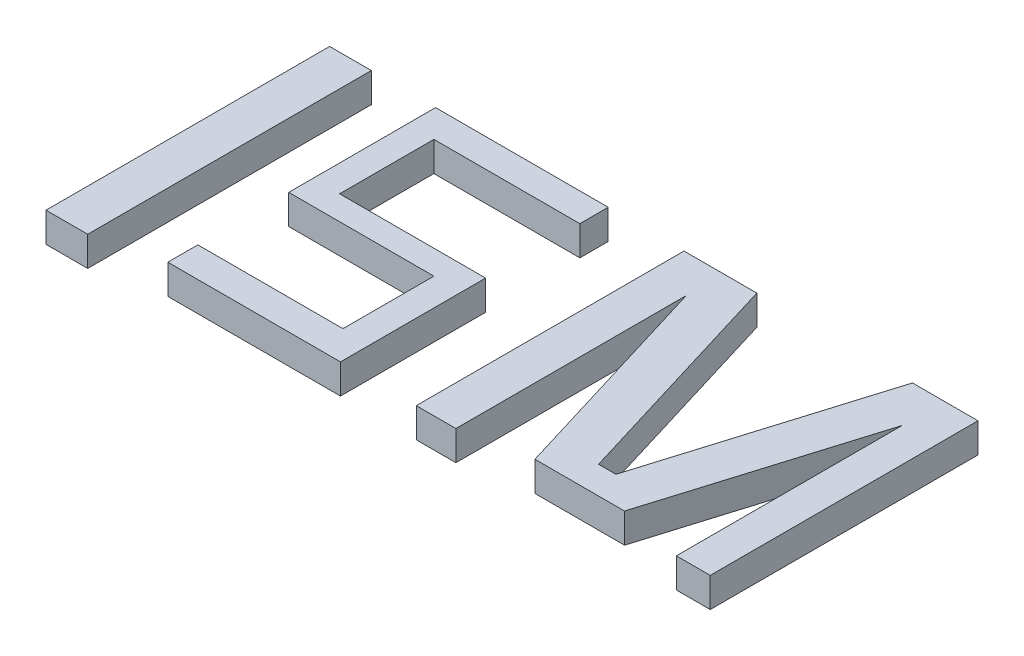
ISO-10303-21;
HEADER;
FILE_DESCRIPTION(('STEP AP214'),'2;1');
FILE_NAME('part.step','',(''),(''),'','','');
FILE_SCHEMA(('AUTOMOTIVE_DESIGN { 1 0 10303 214 1 1 1 1 }'));
ENDSEC;
DATA;
#1=APPLICATION_CONTEXT('core data for automotive mechanical design processes');
#2=APPLICATION_PROTOCOL_DEFINITION('international standard','automotive_design',2000,#1);
#3=PRODUCT_CONTEXT('',#1,'mechanical');
#4=PRODUCT('Part','Part','',(#3));
#5=PRODUCT_RELATED_PRODUCT_CATEGORY('part','',(#4));
#6=PRODUCT_DEFINITION_FORMATION('','',#4);
#7=PRODUCT_DEFINITION_CONTEXT('part definition',#1,'design');
#8=PRODUCT_DEFINITION('design','',#6,#7);
#9=PRODUCT_DEFINITION_SHAPE('','',#8);
#10=(LENGTH_UNIT() NAMED_UNIT(*) SI_UNIT(.MILLI.,.METRE.));
#11=(NAMED_UNIT(*) PLANE_ANGLE_UNIT() SI_UNIT($,.RADIAN.));
#12=(NAMED_UNIT(*) SI_UNIT($,.STERADIAN.) SOLID_ANGLE_UNIT());
#13=UNCERTAINTY_MEASURE_WITH_UNIT(LENGTH_MEASURE(1.E-05),#10,'distance_accuracy_value','');
#14=(GEOMETRIC_REPRESENTATION_CONTEXT(3) GLOBAL_UNCERTAINTY_ASSIGNED_CONTEXT((#13)) GLOBAL_UNIT_ASSIGNED_CONTEXT((#10,
#11,#12)) REPRESENTATION_CONTEXT('',''));
#15=CARTESIAN_POINT('',(0.,0.,0.));
#16=DIRECTION('',(0.,0.,1.));
#17=DIRECTION('',(1.,0.,0.));
#18=AXIS2_PLACEMENT_3D('',#15,#16,#17);
#19=CARTESIAN_POINT('',(28.2958438703198,10.,-42.3733781341606));
#20=DIRECTION('',(-1.,0.,0.));
#21=DIRECTION('',(0.,0.,1.));
#22=AXIS2_PLACEMENT_3D('',#19,#20,#21);
#23=PLANE('',#22);
#24=DIRECTION('',(0.,0.,-1.));
#25=VECTOR('',#24,1.);
#26=CARTESIAN_POINT('',(28.2958438703198,0.,-42.3733781341606));
#27=LINE('',#26,#25);
#28=CARTESIAN_POINT('',(28.2958438703198,0.,-42.3733781341606));
#29=VERTEX_POINT('',#28);
#30=CARTESIAN_POINT('',(28.2958438703198,0.,-51.9461014335723));
#31=VERTEX_POINT('',#30);
#32=EDGE_CURVE('E164',#29,#31,#27,.T.);
#33=ORIENTED_EDGE('',*,*,#32,.T.);
#34=DIRECTION('',(0.,-1.,0.));
#35=VECTOR('',#34,1.);
#36=CARTESIAN_POINT('',(28.2958438703198,10.,-51.9461014335723));
#37=LINE('',#36,#35);
#38=CARTESIAN_POINT('',(28.2958438703198,10.,-51.9461014335723));
#39=VERTEX_POINT('',#38);
#40=EDGE_CURVE('E12',#39,#31,#37,.T.);
#41=ORIENTED_EDGE('',*,*,#40,.F.);
#42=DIRECTION('',(0.,0.,-1.));
#43=VECTOR('',#42,1.);
#44=CARTESIAN_POINT('',(28.2958438703198,10.,-42.3733781341606));
#45=LINE('',#44,#43);
#46=CARTESIAN_POINT('',(28.2958438703198,10.,-42.3733781341606));
#47=VERTEX_POINT('',#46);
#48=EDGE_CURVE('E186',#47,#39,#45,.T.);
#49=ORIENTED_EDGE('',*,*,#48,.F.);
#50=DIRECTION('',(0.,-1.,0.));
#51=VECTOR('',#50,1.);
#52=CARTESIAN_POINT('',(28.2958438703198,10.,-42.3733781341606));
#53=LINE('',#52,#51);
#54=EDGE_CURVE('E160',#47,#29,#53,.T.);
#55=ORIENTED_EDGE('',*,*,#54,.T.);
#56=EDGE_LOOP('',(#33,#41,#49,#55));
#57=FACE_BOUND('',#56,.T.);
#58=ADVANCED_FACE('F44',(#57),#23,.F.);
#59=CARTESIAN_POINT('',(28.2958438703198,10.,-51.9461014335723));
#60=DIRECTION('',(0.,0.,1.));
#61=DIRECTION('',(1.,0.,0.));
#62=AXIS2_PLACEMENT_3D('',#59,#60,#61);
#63=PLANE('',#62);
#64=DIRECTION('',(-1.,0.,0.));
#65=VECTOR('',#64,1.);
#66=CARTESIAN_POINT('',(28.2958438703198,0.,-51.9461014335723));
#67=LINE('',#66,#65);
#68=CARTESIAN_POINT('',(-29.9851479819807,0.,-51.9461014335723));
#69=VERTEX_POINT('',#68);
#70=EDGE_CURVE('E167',#31,#69,#67,.T.);
#71=ORIENTED_EDGE('',*,*,#70,.T.);
#72=DIRECTION('',(0.,-1.,0.));
#73=VECTOR('',#72,1.);
#74=CARTESIAN_POINT('',(-29.9851479819807,10.,-51.9461014335723));
#75=LINE('',#74,#73);
#76=CARTESIAN_POINT('',(-29.9851479819807,10.,-51.9461014335723));
#77=VERTEX_POINT('',#76);
#78=EDGE_CURVE('E52',#77,#69,#75,.T.);
#79=ORIENTED_EDGE('',*,*,#78,.F.);
#80=DIRECTION('',(-1.,0.,0.));
#81=VECTOR('',#80,1.);
#82=CARTESIAN_POINT('',(28.2958438703198,10.,-51.9461014335723));
#83=LINE('',#82,#81);
#84=EDGE_CURVE('E115',#39,#77,#83,.T.);
#85=ORIENTED_EDGE('',*,*,#84,.F.);
#86=ORIENTED_EDGE('',*,*,#40,.T.);
#87=EDGE_LOOP('',(#71,#79,#85,#86));
#88=FACE_BOUND('',#87,.T.);
#89=ADVANCED_FACE('F264',(#88),#63,.F.);
#90=CARTESIAN_POINT('',(-29.9851479819807,10.,-51.9461014335723));
#91=DIRECTION('',(1.,0.,0.));
#92=DIRECTION('',(0.,0.,-1.));
#93=AXIS2_PLACEMENT_3D('',#90,#91,#92);
#94=PLANE('',#93);
#95=DIRECTION('',(0.,0.,1.));
#96=VECTOR('',#95,1.);
#97=CARTESIAN_POINT('',(-29.9851479819807,0.,-51.9461014335723));
#98=LINE('',#97,#96);
#99=CARTESIAN_POINT('',(-29.9851479819807,0.,-2.39318082485292));
#100=VERTEX_POINT('',#99);
#101=EDGE_CURVE('E169',#69,#100,#98,.T.);
#102=ORIENTED_EDGE('',*,*,#101,.T.);
#103=DIRECTION('',(0.,-1.,0.));
#104=VECTOR('',#103,1.);
#105=CARTESIAN_POINT('',(-29.9851479819807,10.,-2.39318082485292));
#106=LINE('',#105,#104);
#107=CARTESIAN_POINT('',(-29.9851479819807,10.,-2.39318082485292));
#108=VERTEX_POINT('',#107);
#109=EDGE_CURVE('E205',#108,#100,#106,.T.);
#110=ORIENTED_EDGE('',*,*,#109,.F.);
#111=DIRECTION('',(0.,0.,1.));
#112=VECTOR('',#111,1.);
#113=CARTESIAN_POINT('',(-29.9851479819807,10.,-51.9461014335723));
#114=LINE('',#113,#112);
#115=EDGE_CURVE('E213',#77,#108,#114,.T.);
#116=ORIENTED_EDGE('',*,*,#115,.F.);
#117=ORIENTED_EDGE('',*,*,#78,.T.);
#118=EDGE_LOOP('',(#102,#110,#116,#117));
#119=FACE_BOUND('',#118,.T.);
#120=ADVANCED_FACE('F211',(#119),#94,.F.);
#121=CARTESIAN_POINT('',(-29.9851479819807,10.,-2.39318082485292));
#122=DIRECTION('',(0.,0.,-1.));
#123=DIRECTION('',(-1.,0.,0.));
#124=AXIS2_PLACEMENT_3D('',#121,#122,#123);
#125=PLANE('',#124);
#126=DIRECTION('',(1.,0.,0.));
#127=VECTOR('',#126,1.);
#128=CARTESIAN_POINT('',(-29.9851479819807,0.,-2.39318082485292));
#129=LINE('',#128,#127);
#130=CARTESIAN_POINT('',(19.004671256185,0.,-2.39318082485292));
#131=VERTEX_POINT('',#130);
#132=EDGE_CURVE('E171',#100,#131,#129,.T.);
#133=ORIENTED_EDGE('',*,*,#132,.T.);
#134=DIRECTION('',(0.,-1.,0.));
#135=VECTOR('',#134,1.);
#136=CARTESIAN_POINT('',(19.004671256185,10.,-2.39318082485292));
#137=LINE('',#136,#135);
#138=CARTESIAN_POINT('',(19.004671256185,10.,-2.39318082485292));
#139=VERTEX_POINT('',#138);
#140=EDGE_CURVE('E202',#139,#131,#137,.T.);
#141=ORIENTED_EDGE('',*,*,#140,.F.);
#142=DIRECTION('',(1.,0.,0.));
#143=VECTOR('',#142,1.);
#144=CARTESIAN_POINT('',(-29.9851479819807,10.,-2.39318082485292));
#145=LINE('',#144,#143);
#146=EDGE_CURVE('E231',#108,#139,#145,.T.);
#147=ORIENTED_EDGE('',*,*,#146,.F.);
#148=ORIENTED_EDGE('',*,*,#109,.T.);
#149=EDGE_LOOP('',(#133,#141,#147,#148));
#150=FACE_BOUND('',#149,.T.);
#151=ADVANCED_FACE('F222',(#150),#125,.F.);
#152=CARTESIAN_POINT('',(19.004671256185,10.,-2.39318082485292));
#153=DIRECTION('',(1.,0.,0.));
#154=DIRECTION('',(0.,0.,-1.));
#155=AXIS2_PLACEMENT_3D('',#152,#153,#154);
#156=PLANE('',#155);
#157=DIRECTION('',(0.,0.,1.));
#158=VECTOR('',#157,1.);
#159=CARTESIAN_POINT('',(19.004671256185,0.,-2.39318082485292));
#160=LINE('',#159,#158);
#161=CARTESIAN_POINT('',(19.004671256185,0.,28.2958438703198));
#162=VERTEX_POINT('',#161);
#163=EDGE_CURVE('E173',#131,#162,#160,.T.);
#164=ORIENTED_EDGE('',*,*,#163,.T.);
#165=DIRECTION('',(0.,-1.,0.));
#166=VECTOR('',#165,1.);
#167=CARTESIAN_POINT('',(19.004671256185,10.,28.2958438703198));
#168=LINE('',#167,#166);
#169=CARTESIAN_POINT('',(19.004671256185,10.,28.2958438703198));
#170=VERTEX_POINT('',#169);
#171=EDGE_CURVE('E199',#170,#162,#168,.T.);
#172=ORIENTED_EDGE('',*,*,#171,.F.);
#173=DIRECTION('',(0.,0.,1.));
#174=VECTOR('',#173,1.);
#175=CARTESIAN_POINT('',(19.004671256185,10.,-2.39318082485292));
#176=LINE('',#175,#174);
#177=EDGE_CURVE('E228',#139,#170,#176,.T.);
#178=ORIENTED_EDGE('',*,*,#177,.F.);
#179=ORIENTED_EDGE('',*,*,#140,.T.);
#180=EDGE_LOOP('',(#164,#172,#178,#179));
#181=FACE_BOUND('',#180,.T.);
#182=ADVANCED_FACE('F226',(#181),#156,.F.);
#183=CARTESIAN_POINT('',(19.004671256185,10.,28.2958438703198));
#184=DIRECTION('',(0.,0.,1.));
#185=DIRECTION('',(1.,0.,0.));
#186=AXIS2_PLACEMENT_3D('',#183,#184,#185);
#187=PLANE('',#186);
#188=DIRECTION('',(-1.,0.,0.));
#189=VECTOR('',#188,1.);
#190=CARTESIAN_POINT('',(19.004671256185,0.,28.2958438703198));
#191=LINE('',#190,#189);
#192=CARTESIAN_POINT('',(-29.9851479819807,0.,28.2958438703198));
#193=VERTEX_POINT('',#192);
#194=EDGE_CURVE('E175',#162,#193,#191,.T.);
#195=ORIENTED_EDGE('',*,*,#194,.T.);
#196=DIRECTION('',(0.,-1.,0.));
#197=VECTOR('',#196,1.);
#198=CARTESIAN_POINT('',(-29.9851479819807,10.,28.2958438703198));
#199=LINE('',#198,#197);
#200=CARTESIAN_POINT('',(-29.9851479819807,10.,28.2958438703198));
#201=VERTEX_POINT('',#200);
#202=EDGE_CURVE('E196',#201,#193,#199,.T.);
#203=ORIENTED_EDGE('',*,*,#202,.F.);
#204=DIRECTION('',(-1.,0.,0.));
#205=VECTOR('',#204,1.);
#206=CARTESIAN_POINT('',(19.004671256185,10.,28.2958438703198));
#207=LINE('',#206,#205);
#208=EDGE_CURVE('E230',#170,#201,#207,.T.);
#209=ORIENTED_EDGE('',*,*,#208,.F.);
#210=ORIENTED_EDGE('',*,*,#171,.T.);
#211=EDGE_LOOP('',(#195,#203,#209,#210));
#212=FACE_BOUND('',#211,.T.);
#213=ADVANCED_FACE('F277',(#212),#187,.F.);
#214=CARTESIAN_POINT('',(-29.9851479819807,10.,28.2958438703198));
#215=DIRECTION('',(1.,0.,0.));
#216=DIRECTION('',(0.,0.,-1.));
#217=AXIS2_PLACEMENT_3D('',#214,#215,#216);
#218=PLANE('',#217);
#219=DIRECTION('',(0.,0.,1.));
#220=VECTOR('',#219,1.);
#221=CARTESIAN_POINT('',(-29.9851479819807,0.,28.2958438703198));
#222=LINE('',#221,#220);
#223=CARTESIAN_POINT('',(-29.9851479819807,0.,38.4316685402852));
#224=VERTEX_POINT('',#223);
#225=EDGE_CURVE('E177',#193,#224,#222,.T.);
#226=ORIENTED_EDGE('',*,*,#225,.T.);
#227=DIRECTION('',(0.,-1.,0.));
#228=VECTOR('',#227,1.);
#229=CARTESIAN_POINT('',(-29.9851479819807,10.,38.4316685402852));
#230=LINE('',#229,#228);
#231=CARTESIAN_POINT('',(-29.9851479819807,10.,38.4316685402852));
#232=VERTEX_POINT('',#231);
#233=EDGE_CURVE('E193',#232,#224,#230,.T.);
#234=ORIENTED_EDGE('',*,*,#233,.F.);
#235=DIRECTION('',(0.,0.,1.));
#236=VECTOR('',#235,1.);
#237=CARTESIAN_POINT('',(-29.9851479819807,10.,28.2958438703198));
#238=LINE('',#237,#236);
#239=EDGE_CURVE('E233',#201,#232,#238,.T.);
#240=ORIENTED_EDGE('',*,*,#239,.F.);
#241=ORIENTED_EDGE('',*,*,#202,.T.);
#242=EDGE_LOOP('',(#226,#234,#240,#241));
#243=FACE_BOUND('',#242,.T.);
#244=ADVANCED_FACE('F280',(#243),#218,.F.);
#245=CARTESIAN_POINT('',(-29.9851479819807,10.,38.4316685402852));
#246=DIRECTION('',(0.,0.,-1.));
#247=DIRECTION('',(-1.,0.,0.));
#248=AXIS2_PLACEMENT_3D('',#245,#246,#247);
#249=PLANE('',#248);
#250=DIRECTION('',(1.,0.,0.));
#251=VECTOR('',#250,1.);
#252=CARTESIAN_POINT('',(-29.9851479819807,0.,38.4316685402852));
#253=LINE('',#252,#251);
#254=CARTESIAN_POINT('',(28.2958438703198,0.,38.4316685402852));
#255=VERTEX_POINT('',#254);
#256=EDGE_CURVE('E179',#224,#255,#253,.T.);
#257=ORIENTED_EDGE('',*,*,#256,.T.);
#258=DIRECTION('',(0.,-1.,0.));
#259=VECTOR('',#258,1.);
#260=CARTESIAN_POINT('',(28.2958438703198,10.,38.4316685402852));
#261=LINE('',#260,#259);
#262=CARTESIAN_POINT('',(28.2958438703198,10.,38.4316685402852));
#263=VERTEX_POINT('',#262);
#264=EDGE_CURVE('E190',#263,#255,#261,.T.);
#265=ORIENTED_EDGE('',*,*,#264,.F.);
#266=DIRECTION('',(1.,0.,0.));
#267=VECTOR('',#266,1.);
#268=CARTESIAN_POINT('',(-29.9851479819807,10.,38.4316685402852));
#269=LINE('',#268,#267);
#270=EDGE_CURVE('E239',#232,#263,#269,.T.);
#271=ORIENTED_EDGE('',*,*,#270,.F.);
#272=ORIENTED_EDGE('',*,*,#233,.T.);
#273=EDGE_LOOP('',(#257,#265,#271,#272));
#274=FACE_BOUND('',#273,.T.);
#275=ADVANCED_FACE('F245',(#274),#249,.F.);
#276=CARTESIAN_POINT('',(28.2958438703198,10.,38.4316685402852));
#277=DIRECTION('',(-1.,0.,0.));
#278=DIRECTION('',(0.,0.,1.));
#279=AXIS2_PLACEMENT_3D('',#276,#277,#278);
#280=PLANE('',#279);
#281=DIRECTION('',(0.,0.,-1.));
#282=VECTOR('',#281,1.);
#283=CARTESIAN_POINT('',(28.2958438703198,0.,38.4316685402852));
#284=LINE('',#283,#282);
#285=CARTESIAN_POINT('',(28.2958438703198,0.,-10.5581506978805));
#286=VERTEX_POINT('',#285);
#287=EDGE_CURVE('E181',#255,#286,#284,.T.);
#288=ORIENTED_EDGE('',*,*,#287,.T.);
#289=DIRECTION('',(0.,-1.,0.));
#290=VECTOR('',#289,1.);
#291=CARTESIAN_POINT('',(28.2958438703198,10.,-10.5581506978805));
#292=LINE('',#291,#290);
#293=CARTESIAN_POINT('',(28.2958438703198,10.,-10.5581506978805));
#294=VERTEX_POINT('',#293);
#295=EDGE_CURVE('E155',#294,#286,#292,.T.);
#296=ORIENTED_EDGE('',*,*,#295,.F.);
#297=DIRECTION('',(0.,0.,-1.));
#298=VECTOR('',#297,1.);
#299=CARTESIAN_POINT('',(28.2958438703198,10.,38.4316685402852));
#300=LINE('',#299,#298);
#301=EDGE_CURVE('E146',#263,#294,#300,.T.);
#302=ORIENTED_EDGE('',*,*,#301,.F.);
#303=ORIENTED_EDGE('',*,*,#264,.T.);
#304=EDGE_LOOP('',(#288,#296,#302,#303));
#305=FACE_BOUND('',#304,.T.);
#306=ADVANCED_FACE('F249',(#305),#280,.F.);
#307=CARTESIAN_POINT('',(28.2958438703198,10.,-10.5581506978805));
#308=DIRECTION('',(0.,0.,1.));
#309=DIRECTION('',(1.,0.,0.));
#310=AXIS2_PLACEMENT_3D('',#307,#308,#309);
#311=PLANE('',#310);
#312=DIRECTION('',(-1.,0.,0.));
#313=VECTOR('',#312,1.);
#314=CARTESIAN_POINT('',(28.2958438703198,0.,-10.5581506978805));
#315=LINE('',#314,#313);
#316=CARTESIAN_POINT('',(-20.9755260531227,0.,-10.5581506978805));
#317=VERTEX_POINT('',#316);
#318=EDGE_CURVE('E154',#286,#317,#315,.T.);
#319=ORIENTED_EDGE('',*,*,#318,.T.);
#320=DIRECTION('',(0.,-1.,0.));
#321=VECTOR('',#320,1.);
#322=CARTESIAN_POINT('',(-20.9755260531227,10.,-10.5581506978805));
#323=LINE('',#322,#321);
#324=CARTESIAN_POINT('',(-20.9755260531227,10.,-10.5581506978805));
#325=VERTEX_POINT('',#324);
#326=EDGE_CURVE('E151',#325,#317,#323,.T.);
#327=ORIENTED_EDGE('',*,*,#326,.F.);
#328=DIRECTION('',(-1.,0.,0.));
#329=VECTOR('',#328,1.);
#330=CARTESIAN_POINT('',(28.2958438703198,10.,-10.5581506978805));
#331=LINE('',#330,#329);
#332=EDGE_CURVE('E140',#294,#325,#331,.T.);
#333=ORIENTED_EDGE('',*,*,#332,.F.);
#334=ORIENTED_EDGE('',*,*,#295,.T.);
#335=EDGE_LOOP('',(#319,#327,#333,#334));
#336=FACE_BOUND('',#335,.T.);
#337=ADVANCED_FACE('F152',(#336),#311,.F.);
#338=CARTESIAN_POINT('',(-20.9755260531227,10.,-10.5581506978805));
#339=DIRECTION('',(-1.,0.,0.));
#340=DIRECTION('',(0.,0.,1.));
#341=AXIS2_PLACEMENT_3D('',#338,#339,#340);
#342=PLANE('',#341);
#343=DIRECTION('',(0.,0.,-1.));
#344=VECTOR('',#343,1.);
#345=CARTESIAN_POINT('',(-20.9755260531227,0.,-10.5581506978805));
#346=LINE('',#345,#344);
#347=CARTESIAN_POINT('',(-20.9755260531227,0.,-42.3733781341606));
#348=VERTEX_POINT('',#347);
#349=EDGE_CURVE('E101',#317,#348,#346,.T.);
#350=ORIENTED_EDGE('',*,*,#349,.T.);
#351=DIRECTION('',(0.,-1.,0.));
#352=VECTOR('',#351,1.);
#353=CARTESIAN_POINT('',(-20.9755260531227,10.,-42.3733781341606));
#354=LINE('',#353,#352);
#355=CARTESIAN_POINT('',(-20.9755260531227,10.,-42.3733781341606));
#356=VERTEX_POINT('',#355);
#357=EDGE_CURVE('E156',#356,#348,#354,.T.);
#358=ORIENTED_EDGE('',*,*,#357,.F.);
#359=DIRECTION('',(0.,0.,-1.));
#360=VECTOR('',#359,1.);
#361=CARTESIAN_POINT('',(-20.9755260531227,10.,-10.5581506978805));
#362=LINE('',#361,#360);
#363=EDGE_CURVE('E144',#325,#356,#362,.T.);
#364=ORIENTED_EDGE('',*,*,#363,.F.);
#365=ORIENTED_EDGE('',*,*,#326,.T.);
#366=EDGE_LOOP('',(#350,#358,#364,#365));
#367=FACE_BOUND('',#366,.T.);
#368=ADVANCED_FACE('F158',(#367),#342,.F.);
#369=CARTESIAN_POINT('',(-20.9755260531227,10.,-42.3733781341606));
#370=DIRECTION('',(0.,0.,-1.));
#371=DIRECTION('',(-1.,0.,0.));
#372=AXIS2_PLACEMENT_3D('',#369,#370,#371);
#373=PLANE('',#372);
#374=DIRECTION('',(1.,0.,0.));
#375=VECTOR('',#374,1.);
#376=CARTESIAN_POINT('',(-20.9755260531227,0.,-42.3733781341606));
#377=LINE('',#376,#375);
#378=EDGE_CURVE('E107',#348,#29,#377,.T.);
#379=ORIENTED_EDGE('',*,*,#378,.T.);
#380=ORIENTED_EDGE('',*,*,#54,.F.);
#381=DIRECTION('',(1.,0.,0.));
#382=VECTOR('',#381,1.);
#383=CARTESIAN_POINT('',(-20.9755260531227,10.,-42.3733781341606));
#384=LINE('',#383,#382);
#385=EDGE_CURVE('E60',#356,#47,#384,.T.);
#386=ORIENTED_EDGE('',*,*,#385,.F.);
#387=ORIENTED_EDGE('',*,*,#357,.T.);
#388=EDGE_LOOP('',(#379,#380,#386,#387));
#389=FACE_BOUND('',#388,.T.);
#390=ADVANCED_FACE('F253',(#389),#373,.F.);
#391=CARTESIAN_POINT('',(0.,10.,0.));
#392=DIRECTION('',(0.,1.,0.));
#393=DIRECTION('',(0.,0.,1.));
#394=AXIS2_PLACEMENT_3D('',#391,#392,#393);
#395=PLANE('',#394);
#396=ORIENTED_EDGE('',*,*,#48,.T.);
#397=ORIENTED_EDGE('',*,*,#84,.T.);
#398=ORIENTED_EDGE('',*,*,#115,.T.);
#399=ORIENTED_EDGE('',*,*,#146,.T.);
#400=ORIENTED_EDGE('',*,*,#177,.T.);
#401=ORIENTED_EDGE('',*,*,#208,.T.);
#402=ORIENTED_EDGE('',*,*,#239,.T.);
#403=ORIENTED_EDGE('',*,*,#270,.T.);
#404=ORIENTED_EDGE('',*,*,#301,.T.);
#405=ORIENTED_EDGE('',*,*,#332,.T.);
#406=ORIENTED_EDGE('',*,*,#363,.T.);
#407=ORIENTED_EDGE('',*,*,#385,.T.);
#408=EDGE_LOOP('',(#396,#397,#398,#399,#400,#401,#402,#403,#404,#405,#406,#407));
#409=FACE_BOUND('',#408,.T.);
#410=ADVANCED_FACE('F142',(#409),#395,.T.);
#411=CARTESIAN_POINT('',(0.,0.,0.));
#412=DIRECTION('',(0.,1.,0.));
#413=DIRECTION('',(0.,0.,1.));
#414=AXIS2_PLACEMENT_3D('',#411,#412,#413);
#415=PLANE('',#414);
#416=ORIENTED_EDGE('',*,*,#32,.F.);
#417=ORIENTED_EDGE('',*,*,#378,.F.);
#418=ORIENTED_EDGE('',*,*,#349,.F.);
#419=ORIENTED_EDGE('',*,*,#318,.F.);
#420=ORIENTED_EDGE('',*,*,#287,.F.);
#421=ORIENTED_EDGE('',*,*,#256,.F.);
#422=ORIENTED_EDGE('',*,*,#225,.F.);
#423=ORIENTED_EDGE('',*,*,#194,.F.);
#424=ORIENTED_EDGE('',*,*,#163,.F.);
#425=ORIENTED_EDGE('',*,*,#132,.F.);
#426=ORIENTED_EDGE('',*,*,#101,.F.);
#427=ORIENTED_EDGE('',*,*,#70,.F.);
#428=EDGE_LOOP('',(#416,#417,#418,#419,#420,#421,#422,#423,#424,#425,#426,#427));
#429=FACE_BOUND('',#428,.T.);
#430=ADVANCED_FACE('F217',(#429),#415,.F.);
#431=CLOSED_SHELL('',(#58,#89,#120,#151,#182,#213,#244,#275,#306,#337,#368,#390,#410,#430));
#432=MANIFOLD_SOLID_BREP('B2',#431);
#433=CARTESIAN_POINT('',(67.2559885399483,10.,38.4316685402852));
#434=DIRECTION('',(0.,0.,-1.));
#435=DIRECTION('',(-1.,0.,0.));
#436=AXIS2_PLACEMENT_3D('',#433,#434,#435);
#437=PLANE('',#436);
#438=DIRECTION('',(1.,0.,0.));
#439=VECTOR('',#438,1.);
#440=CARTESIAN_POINT('',(67.2559885399483,0.,38.4316685402852));
#441=LINE('',#440,#439);
#442=CARTESIAN_POINT('',(53.8812346254109,0.,38.4316685402852));
#443=VERTEX_POINT('',#442);
#444=CARTESIAN_POINT('',(67.2559885399483,0.,38.4316685402852));
#445=VERTEX_POINT('',#444);
#446=EDGE_CURVE('E517',#443,#445,#441,.T.);
#447=ORIENTED_EDGE('',*,*,#446,.T.);
#448=DIRECTION('',(0.,-1.,0.));
#449=VECTOR('',#448,1.);
#450=CARTESIAN_POINT('',(67.2559885399483,10.,38.4316685402852));
#451=LINE('',#450,#449);
#452=CARTESIAN_POINT('',(67.2559885399483,10.,38.4316685402852));
#453=VERTEX_POINT('',#452);
#454=EDGE_CURVE('E42',#453,#445,#451,.T.);
#455=ORIENTED_EDGE('',*,*,#454,.F.);
#456=DIRECTION('',(1.,0.,0.));
#457=VECTOR('',#456,1.);
#458=CARTESIAN_POINT('',(67.2559885399483,10.,38.4316685402852));
#459=LINE('',#458,#457);
#460=CARTESIAN_POINT('',(53.8812346254109,10.,38.4316685402852));
#461=VERTEX_POINT('',#460);
#462=EDGE_CURVE('E543',#461,#453,#459,.T.);
#463=ORIENTED_EDGE('',*,*,#462,.F.);
#464=DIRECTION('',(0.,-1.,0.));
#465=VECTOR('',#464,1.);
#466=CARTESIAN_POINT('',(53.8812346254109,10.,38.4316685402852));
#467=LINE('',#466,#465);
#468=EDGE_CURVE('E513',#461,#443,#467,.T.);
#469=ORIENTED_EDGE('',*,*,#468,.T.);
#470=EDGE_LOOP('',(#447,#455,#463,#469));
#471=FACE_BOUND('',#470,.T.);
#472=ADVANCED_FACE('F385',(#471),#437,.F.);
#473=CARTESIAN_POINT('',(67.2559885399483,10.,-39.3284985728338));
#474=DIRECTION('',(-1.,0.,0.));
#475=DIRECTION('',(0.,0.,1.));
#476=AXIS2_PLACEMENT_3D('',#473,#474,#475);
#477=PLANE('',#476);
#478=DIRECTION('',(0.,0.,-1.));
#479=VECTOR('',#478,1.);
#480=CARTESIAN_POINT('',(67.2559885399483,0.,-39.3284985728338));
#481=LINE('',#480,#479);
#482=CARTESIAN_POINT('',(67.2559885399483,0.,-39.3284985728338));
#483=VERTEX_POINT('',#482);
#484=EDGE_CURVE('E520',#445,#483,#481,.T.);
#485=ORIENTED_EDGE('',*,*,#484,.T.);
#486=DIRECTION('',(0.,-1.,0.));
#487=VECTOR('',#486,1.);
#488=CARTESIAN_POINT('',(67.2559885399483,10.,-39.3284985728338));
#489=LINE('',#488,#487);
#490=CARTESIAN_POINT('',(67.2559885399483,10.,-39.3284985728338));
#491=VERTEX_POINT('',#490);
#492=EDGE_CURVE('E393',#491,#483,#489,.T.);
#493=ORIENTED_EDGE('',*,*,#492,.F.);
#494=DIRECTION('',(0.,0.,-1.));
#495=VECTOR('',#494,1.);
#496=CARTESIAN_POINT('',(67.2559885399483,10.,-39.3284985728338));
#497=LINE('',#496,#495);
#498=EDGE_CURVE('E462',#453,#491,#497,.T.);
#499=ORIENTED_EDGE('',*,*,#498,.F.);
#500=ORIENTED_EDGE('',*,*,#454,.T.);
#501=EDGE_LOOP('',(#485,#493,#499,#500));
#502=FACE_BOUND('',#501,.T.);
#503=ADVANCED_FACE('F631',(#502),#477,.F.);
#504=CARTESIAN_POINT('',(89.5774576767944,10.,34.082232257414));
#505=DIRECTION('',(0.956749818901272,0.,-0.29091198674579));
#506=DIRECTION('',(-0.29091198674579,0.,-0.956749818901272));
#507=AXIS2_PLACEMENT_3D('',#504,#505,#506);
#508=PLANE('',#507);
#509=DIRECTION('',(0.29091198674579,0.,0.956749818901272));
#510=VECTOR('',#509,1.);
#511=CARTESIAN_POINT('',(89.5774576767944,0.,34.082232257414));
#512=LINE('',#511,#510);
#513=CARTESIAN_POINT('',(89.5774576767944,0.,34.082232257414));
#514=VERTEX_POINT('',#513);
#515=EDGE_CURVE('E522',#483,#514,#512,.T.);
#516=ORIENTED_EDGE('',*,*,#515,.T.);
#517=DIRECTION('',(0.,-1.,0.));
#518=VECTOR('',#517,1.);
#519=CARTESIAN_POINT('',(89.5774576767944,10.,34.082232257414));
#520=LINE('',#519,#518);
#521=CARTESIAN_POINT('',(89.5774576767944,10.,34.082232257414));
#522=VERTEX_POINT('',#521);
#523=EDGE_CURVE('E568',#522,#514,#520,.T.);
#524=ORIENTED_EDGE('',*,*,#523,.F.);
#525=DIRECTION('',(0.29091198674579,0.,0.956749818901272));
#526=VECTOR('',#525,1.);
#527=CARTESIAN_POINT('',(89.5774576767944,10.,34.082232257414));
#528=LINE('',#527,#526);
#529=EDGE_CURVE('E576',#491,#522,#528,.T.);
#530=ORIENTED_EDGE('',*,*,#529,.F.);
#531=ORIENTED_EDGE('',*,*,#492,.T.);
#532=EDGE_LOOP('',(#516,#524,#530,#531));
#533=FACE_BOUND('',#532,.T.);
#534=ADVANCED_FACE('F574',(#533),#508,.F.);
#535=CARTESIAN_POINT('',(89.5774576767944,10.,34.082232257414));
#536=DIRECTION('',(0.,0.,-1.));
#537=DIRECTION('',(-1.,0.,0.));
#538=AXIS2_PLACEMENT_3D('',#535,#536,#537);
#539=PLANE('',#538);
#540=DIRECTION('',(1.,0.,0.));
#541=VECTOR('',#540,1.);
#542=CARTESIAN_POINT('',(89.5774576767944,0.,34.082232257414));
#543=LINE('',#542,#541);
#544=CARTESIAN_POINT('',(119.823976618102,0.,34.082232257414));
#545=VERTEX_POINT('',#544);
#546=EDGE_CURVE('E524',#514,#545,#543,.T.);
#547=ORIENTED_EDGE('',*,*,#546,.T.);
#548=DIRECTION('',(0.,-1.,0.));
#549=VECTOR('',#548,1.);
#550=CARTESIAN_POINT('',(119.823976618102,10.,34.082232257414));
#551=LINE('',#550,#549);
#552=CARTESIAN_POINT('',(119.823976618102,10.,34.082232257414));
#553=VERTEX_POINT('',#552);
#554=EDGE_CURVE('E565',#553,#545,#551,.T.);
#555=ORIENTED_EDGE('',*,*,#554,.F.);
#556=DIRECTION('',(1.,0.,0.));
#557=VECTOR('',#556,1.);
#558=CARTESIAN_POINT('',(89.5774576767944,10.,34.082232257414));
#559=LINE('',#558,#557);
#560=EDGE_CURVE('E594',#522,#553,#559,.T.);
#561=ORIENTED_EDGE('',*,*,#560,.F.);
#562=ORIENTED_EDGE('',*,*,#523,.T.);
#563=EDGE_LOOP('',(#547,#555,#561,#562));
#564=FACE_BOUND('',#563,.T.);
#565=ADVANCED_FACE('F585',(#564),#539,.F.);
#566=CARTESIAN_POINT('',(119.823976618102,10.,34.082232257414));
#567=DIRECTION('',(-0.956749818901274,0.,-0.290911986745783));
#568=DIRECTION('',(-0.290911986745783,0.,0.956749818901274));
#569=AXIS2_PLACEMENT_3D('',#566,#567,#568);
#570=PLANE('',#569);
#571=DIRECTION('',(0.290911986745783,0.,-0.956749818901274));
#572=VECTOR('',#571,1.);
#573=CARTESIAN_POINT('',(119.823976618102,0.,34.082232257414));
#574=LINE('',#573,#572);
#575=CARTESIAN_POINT('',(141.665334196307,0.,-37.7495101924616));
#576=VERTEX_POINT('',#575);
#577=EDGE_CURVE('E526',#545,#576,#574,.T.);
#578=ORIENTED_EDGE('',*,*,#577,.T.);
#579=DIRECTION('',(0.,-1.,0.));
#580=VECTOR('',#579,1.);
#581=CARTESIAN_POINT('',(141.665334196307,10.,-37.7495101924616));
#582=LINE('',#581,#580);
#583=CARTESIAN_POINT('',(141.665334196307,10.,-37.7495101924616));
#584=VERTEX_POINT('',#583);
#585=EDGE_CURVE('E562',#584,#576,#582,.T.);
#586=ORIENTED_EDGE('',*,*,#585,.F.);
#587=DIRECTION('',(0.290911986745783,0.,-0.956749818901274));
#588=VECTOR('',#587,1.);
#589=CARTESIAN_POINT('',(119.823976618102,10.,34.082232257414));
#590=LINE('',#589,#588);
#591=EDGE_CURVE('E591',#553,#584,#590,.T.);
#592=ORIENTED_EDGE('',*,*,#591,.F.);
#593=ORIENTED_EDGE('',*,*,#554,.T.);
#594=EDGE_LOOP('',(#578,#586,#592,#593));
#595=FACE_BOUND('',#594,.T.);
#596=ADVANCED_FACE('F589',(#595),#570,.F.);
#597=CARTESIAN_POINT('',(141.665334196307,10.,-37.7495101924616));
#598=DIRECTION('',(1.,0.,0.));
#599=DIRECTION('',(0.,0.,-1.));
#600=AXIS2_PLACEMENT_3D('',#597,#598,#599);
#601=PLANE('',#600);
#602=DIRECTION('',(0.,0.,1.));
#603=VECTOR('',#602,1.);
#604=CARTESIAN_POINT('',(141.665334196307,0.,-37.7495101924616));
#605=LINE('',#604,#603);
#606=CARTESIAN_POINT('',(141.665334196307,0.,38.431668540285));
#607=VERTEX_POINT('',#606);
#608=EDGE_CURVE('E528',#576,#607,#605,.T.);
#609=ORIENTED_EDGE('',*,*,#608,.T.);
#610=DIRECTION('',(0.,-1.,0.));
#611=VECTOR('',#610,1.);
#612=CARTESIAN_POINT('',(141.665334196307,10.,38.431668540285));
#613=LINE('',#612,#611);
#614=CARTESIAN_POINT('',(141.665334196307,10.,38.431668540285));
#615=VERTEX_POINT('',#614);
#616=EDGE_CURVE('E559',#615,#607,#613,.T.);
#617=ORIENTED_EDGE('',*,*,#616,.F.);
#618=DIRECTION('',(0.,0.,1.));
#619=VECTOR('',#618,1.);
#620=CARTESIAN_POINT('',(141.665334196307,10.,-37.7495101924616));
#621=LINE('',#620,#619);
#622=EDGE_CURVE('E593',#584,#615,#621,.T.);
#623=ORIENTED_EDGE('',*,*,#622,.F.);
#624=ORIENTED_EDGE('',*,*,#585,.T.);
#625=EDGE_LOOP('',(#609,#617,#623,#624));
#626=FACE_BOUND('',#625,.T.);
#627=ADVANCED_FACE('F644',(#626),#601,.F.);
#628=CARTESIAN_POINT('',(141.665334196307,10.,38.431668540285));
#629=DIRECTION('',(0.,0.,-1.));
#630=DIRECTION('',(-1.,0.,0.));
#631=AXIS2_PLACEMENT_3D('',#628,#629,#630);
#632=PLANE('',#631);
#633=DIRECTION('',(1.,0.,0.));
#634=VECTOR('',#633,1.);
#635=CARTESIAN_POINT('',(141.665334196307,0.,38.431668540285));
#636=LINE('',#635,#634);
#637=CARTESIAN_POINT('',(153.096678857873,0.,38.431668540285));
#638=VERTEX_POINT('',#637);
#639=EDGE_CURVE('E530',#607,#638,#636,.T.);
#640=ORIENTED_EDGE('',*,*,#639,.T.);
#641=DIRECTION('',(0.,-1.,0.));
#642=VECTOR('',#641,1.);
#643=CARTESIAN_POINT('',(153.096678857873,10.,38.431668540285));
#644=LINE('',#643,#642);
#645=CARTESIAN_POINT('',(153.096678857873,10.,38.431668540285));
#646=VERTEX_POINT('',#645);
#647=EDGE_CURVE('E556',#646,#638,#644,.T.);
#648=ORIENTED_EDGE('',*,*,#647,.F.);
#649=DIRECTION('',(1.,0.,0.));
#650=VECTOR('',#649,1.);
#651=CARTESIAN_POINT('',(141.665334196307,10.,38.431668540285));
#652=LINE('',#651,#650);
#653=EDGE_CURVE('E596',#615,#646,#652,.T.);
#654=ORIENTED_EDGE('',*,*,#653,.F.);
#655=ORIENTED_EDGE('',*,*,#616,.T.);
#656=EDGE_LOOP('',(#640,#648,#654,#655));
#657=FACE_BOUND('',#656,.T.);
#658=ADVANCED_FACE('F647',(#657),#632,.F.);
#659=CARTESIAN_POINT('',(153.096678857873,10.,38.431668540285));
#660=DIRECTION('',(-1.,0.,0.));
#661=DIRECTION('',(0.,0.,1.));
#662=AXIS2_PLACEMENT_3D('',#659,#660,#661);
#663=PLANE('',#662);
#664=DIRECTION('',(0.,0.,-1.));
#665=VECTOR('',#664,1.);
#666=CARTESIAN_POINT('',(153.096678857873,0.,38.431668540285));
#667=LINE('',#666,#665);
#668=CARTESIAN_POINT('',(153.096678857873,0.,-51.9461014335725));
#669=VERTEX_POINT('',#668);
#670=EDGE_CURVE('E532',#638,#669,#667,.T.);
#671=ORIENTED_EDGE('',*,*,#670,.T.);
#672=DIRECTION('',(0.,-1.,0.));
#673=VECTOR('',#672,1.);
#674=CARTESIAN_POINT('',(153.096678857873,10.,-51.9461014335725));
#675=LINE('',#674,#673);
#676=CARTESIAN_POINT('',(153.096678857873,10.,-51.9461014335725));
#677=VERTEX_POINT('',#676);
#678=EDGE_CURVE('E553',#677,#669,#675,.T.);
#679=ORIENTED_EDGE('',*,*,#678,.F.);
#680=DIRECTION('',(0.,0.,-1.));
#681=VECTOR('',#680,1.);
#682=CARTESIAN_POINT('',(153.096678857873,10.,38.431668540285));
#683=LINE('',#682,#681);
#684=EDGE_CURVE('E602',#646,#677,#683,.T.);
#685=ORIENTED_EDGE('',*,*,#684,.F.);
#686=ORIENTED_EDGE('',*,*,#647,.T.);
#687=EDGE_LOOP('',(#671,#679,#685,#686));
#688=FACE_BOUND('',#687,.T.);
#689=ADVANCED_FACE('F651',(#688),#663,.F.);
#690=CARTESIAN_POINT('',(153.096678857873,10.,-51.9461014335725));
#691=DIRECTION('',(0.,0.,1.));
#692=DIRECTION('',(1.,0.,0.));
#693=AXIS2_PLACEMENT_3D('',#690,#691,#692);
#694=PLANE('',#693);
#695=DIRECTION('',(-1.,0.,0.));
#696=VECTOR('',#695,1.);
#697=CARTESIAN_POINT('',(153.096678857873,0.,-51.9461014335725));
#698=LINE('',#697,#696);
#699=CARTESIAN_POINT('',(130.974164884891,0.,-51.9461014335725));
#700=VERTEX_POINT('',#699);
#701=EDGE_CURVE('E534',#669,#700,#698,.T.);
#702=ORIENTED_EDGE('',*,*,#701,.T.);
#703=DIRECTION('',(0.,-1.,0.));
#704=VECTOR('',#703,1.);
#705=CARTESIAN_POINT('',(130.974164884891,10.,-51.9461014335725));
#706=LINE('',#705,#704);
#707=CARTESIAN_POINT('',(130.974164884891,10.,-51.9461014335725));
#708=VERTEX_POINT('',#707);
#709=EDGE_CURVE('E550',#708,#700,#706,.T.);
#710=ORIENTED_EDGE('',*,*,#709,.F.);
#711=DIRECTION('',(-1.,0.,0.));
#712=VECTOR('',#711,1.);
#713=CARTESIAN_POINT('',(153.096678857873,10.,-51.9461014335725));
#714=LINE('',#713,#712);
#715=EDGE_CURVE('E604',#677,#708,#714,.T.);
#716=ORIENTED_EDGE('',*,*,#715,.F.);
#717=ORIENTED_EDGE('',*,*,#678,.T.);
#718=EDGE_LOOP('',(#702,#710,#716,#717));
#719=FACE_BOUND('',#718,.T.);
#720=ADVANCED_FACE('F655',(#719),#694,.F.);
#721=CARTESIAN_POINT('',(130.974164884891,10.,-51.9461014335725));
#722=DIRECTION('',(0.956749818901274,0.,0.290911986745784));
#723=DIRECTION('',(0.290911986745784,0.,-0.956749818901274));
#724=AXIS2_PLACEMENT_3D('',#721,#722,#723);
#725=PLANE('',#724);
#726=DIRECTION('',(-0.290911986745784,0.,0.956749818901274));
#727=VECTOR('',#726,1.);
#728=CARTESIAN_POINT('',(130.974164884891,0.,-51.9461014335725));
#729=LINE('',#728,#727);
#730=CARTESIAN_POINT('',(107.636178779973,0.,24.8077450791621));
#731=VERTEX_POINT('',#730);
#732=EDGE_CURVE('E536',#700,#731,#729,.T.);
#733=ORIENTED_EDGE('',*,*,#732,.T.);
#734=DIRECTION('',(0.,-1.,0.));
#735=VECTOR('',#734,1.);
#736=CARTESIAN_POINT('',(107.636178779973,10.,24.8077450791621));
#737=LINE('',#736,#735);
#738=CARTESIAN_POINT('',(107.636178779973,10.,24.8077450791621));
#739=VERTEX_POINT('',#738);
#740=EDGE_CURVE('E547',#739,#731,#737,.T.);
#741=ORIENTED_EDGE('',*,*,#740,.F.);
#742=DIRECTION('',(-0.290911986745784,0.,0.956749818901274));
#743=VECTOR('',#742,1.);
#744=CARTESIAN_POINT('',(130.974164884891,10.,-51.9461014335725));
#745=LINE('',#744,#743);
#746=EDGE_CURVE('E606',#708,#739,#745,.T.);
#747=ORIENTED_EDGE('',*,*,#746,.F.);
#748=ORIENTED_EDGE('',*,*,#709,.T.);
#749=EDGE_LOOP('',(#733,#741,#747,#748));
#750=FACE_BOUND('',#749,.T.);
#751=ADVANCED_FACE('F612',(#750),#725,.F.);
#752=CARTESIAN_POINT('',(101.788622723726,10.,24.8077450791621));
#753=DIRECTION('',(0.,0.,1.));
#754=DIRECTION('',(1.,0.,0.));
#755=AXIS2_PLACEMENT_3D('',#752,#753,#754);
#756=PLANE('',#755);
#757=DIRECTION('',(-1.,0.,0.));
#758=VECTOR('',#757,1.);
#759=CARTESIAN_POINT('',(101.788622723726,0.,24.8077450791621));
#760=LINE('',#759,#758);
#761=CARTESIAN_POINT('',(101.788622723726,0.,24.8077450791621));
#762=VERTEX_POINT('',#761);
#763=EDGE_CURVE('E538',#731,#762,#760,.T.);
#764=ORIENTED_EDGE('',*,*,#763,.T.);
#765=DIRECTION('',(0.,-1.,0.));
#766=VECTOR('',#765,1.);
#767=CARTESIAN_POINT('',(101.788622723726,10.,24.8077450791621));
#768=LINE('',#767,#766);
#769=CARTESIAN_POINT('',(101.788622723726,10.,24.8077450791621));
#770=VERTEX_POINT('',#769);
#771=EDGE_CURVE('E508',#770,#762,#768,.T.);
#772=ORIENTED_EDGE('',*,*,#771,.F.);
#773=DIRECTION('',(-1.,0.,0.));
#774=VECTOR('',#773,1.);
#775=CARTESIAN_POINT('',(101.788622723726,10.,24.8077450791621));
#776=LINE('',#775,#774);
#777=EDGE_CURVE('E499',#739,#770,#776,.T.);
#778=ORIENTED_EDGE('',*,*,#777,.F.);
#779=ORIENTED_EDGE('',*,*,#740,.T.);
#780=EDGE_LOOP('',(#764,#772,#778,#779));
#781=FACE_BOUND('',#780,.T.);
#782=ADVANCED_FACE('F616',(#781),#756,.F.);
#783=CARTESIAN_POINT('',(78.450636618808,10.,-51.9461014335723));
#784=DIRECTION('',(-0.956749818901272,0.,0.29091198674579));
#785=DIRECTION('',(0.29091198674579,0.,0.956749818901272));
#786=AXIS2_PLACEMENT_3D('',#783,#784,#785);
#787=PLANE('',#786);
#788=DIRECTION('',(-0.29091198674579,0.,-0.956749818901272));
#789=VECTOR('',#788,1.);
#790=CARTESIAN_POINT('',(78.450636618808,0.,-51.9461014335723));
#791=LINE('',#790,#789);
#792=CARTESIAN_POINT('',(78.450636618808,0.,-51.9461014335723));
#793=VERTEX_POINT('',#792);
#794=EDGE_CURVE('E507',#762,#793,#791,.T.);
#795=ORIENTED_EDGE('',*,*,#794,.T.);
#796=DIRECTION('',(0.,-1.,0.));
#797=VECTOR('',#796,1.);
#798=CARTESIAN_POINT('',(78.450636618808,10.,-51.9461014335723));
#799=LINE('',#798,#797);
#800=CARTESIAN_POINT('',(78.450636618808,10.,-51.9461014335723));
#801=VERTEX_POINT('',#800);
#802=EDGE_CURVE('E504',#801,#793,#799,.T.);
#803=ORIENTED_EDGE('',*,*,#802,.F.);
#804=DIRECTION('',(-0.29091198674579,0.,-0.956749818901272));
#805=VECTOR('',#804,1.);
#806=CARTESIAN_POINT('',(78.450636618808,10.,-51.9461014335723));
#807=LINE('',#806,#805);
#808=EDGE_CURVE('E493',#770,#801,#807,.T.);
#809=ORIENTED_EDGE('',*,*,#808,.F.);
#810=ORIENTED_EDGE('',*,*,#771,.T.);
#811=EDGE_LOOP('',(#795,#803,#809,#810));
#812=FACE_BOUND('',#811,.T.);
#813=ADVANCED_FACE('F505',(#812),#787,.F.);
#814=CARTESIAN_POINT('',(53.8812346254109,10.,-51.9461014335723));
#815=DIRECTION('',(0.,0.,1.));
#816=DIRECTION('',(1.,0.,0.));
#817=AXIS2_PLACEMENT_3D('',#814,#815,#816);
#818=PLANE('',#817);
#819=DIRECTION('',(-1.,0.,0.));
#820=VECTOR('',#819,1.);
#821=CARTESIAN_POINT('',(53.8812346254109,0.,-51.9461014335723));
#822=LINE('',#821,#820);
#823=CARTESIAN_POINT('',(53.8812346254109,0.,-51.9461014335723));
#824=VERTEX_POINT('',#823);
#825=EDGE_CURVE('E448',#793,#824,#822,.T.);
#826=ORIENTED_EDGE('',*,*,#825,.T.);
#827=DIRECTION('',(0.,-1.,0.));
#828=VECTOR('',#827,1.);
#829=CARTESIAN_POINT('',(53.8812346254109,10.,-51.9461014335723));
#830=LINE('',#829,#828);
#831=CARTESIAN_POINT('',(53.8812346254109,10.,-51.9461014335723));
#832=VERTEX_POINT('',#831);
#833=EDGE_CURVE('E509',#832,#824,#830,.T.);
#834=ORIENTED_EDGE('',*,*,#833,.F.);
#835=DIRECTION('',(-1.,0.,0.));
#836=VECTOR('',#835,1.);
#837=CARTESIAN_POINT('',(53.8812346254109,10.,-51.9461014335723));
#838=LINE('',#837,#836);
#839=EDGE_CURVE('E497',#801,#832,#838,.T.);
#840=ORIENTED_EDGE('',*,*,#839,.F.);
#841=ORIENTED_EDGE('',*,*,#802,.T.);
#842=EDGE_LOOP('',(#826,#834,#840,#841));
#843=FACE_BOUND('',#842,.T.);
#844=ADVANCED_FACE('F511',(#843),#818,.F.);
#845=CARTESIAN_POINT('',(53.8812346254109,10.,38.4316685402852));
#846=DIRECTION('',(1.,0.,0.));
#847=DIRECTION('',(0.,0.,-1.));
#848=AXIS2_PLACEMENT_3D('',#845,#846,#847);
#849=PLANE('',#848);
#850=DIRECTION('',(0.,0.,1.));
#851=VECTOR('',#850,1.);
#852=CARTESIAN_POINT('',(53.8812346254109,0.,38.4316685402852));
#853=LINE('',#852,#851);
#854=EDGE_CURVE('E454',#824,#443,#853,.T.);
#855=ORIENTED_EDGE('',*,*,#854,.T.);
#856=ORIENTED_EDGE('',*,*,#468,.F.);
#857=DIRECTION('',(0.,0.,1.));
#858=VECTOR('',#857,1.);
#859=CARTESIAN_POINT('',(53.8812346254109,10.,38.4316685402852));
#860=LINE('',#859,#858);
#861=EDGE_CURVE('E401',#832,#461,#860,.T.);
#862=ORIENTED_EDGE('',*,*,#861,.F.);
#863=ORIENTED_EDGE('',*,*,#833,.T.);
#864=EDGE_LOOP('',(#855,#856,#862,#863));
#865=FACE_BOUND('',#864,.T.);
#866=ADVANCED_FACE('F620',(#865),#849,.F.);
#867=CARTESIAN_POINT('',(0.,10.,0.));
#868=DIRECTION('',(0.,-1.,0.));
#869=DIRECTION('',(0.,0.,-1.));
#870=AXIS2_PLACEMENT_3D('',#867,#868,#869);
#871=PLANE('',#870);
#872=ORIENTED_EDGE('',*,*,#462,.T.);
#873=ORIENTED_EDGE('',*,*,#498,.T.);
#874=ORIENTED_EDGE('',*,*,#529,.T.);
#875=ORIENTED_EDGE('',*,*,#560,.T.);
#876=ORIENTED_EDGE('',*,*,#591,.T.);
#877=ORIENTED_EDGE('',*,*,#622,.T.);
#878=ORIENTED_EDGE('',*,*,#653,.T.);
#879=ORIENTED_EDGE('',*,*,#684,.T.);
#880=ORIENTED_EDGE('',*,*,#715,.T.);
#881=ORIENTED_EDGE('',*,*,#746,.T.);
#882=ORIENTED_EDGE('',*,*,#777,.T.);
#883=ORIENTED_EDGE('',*,*,#808,.T.);
#884=ORIENTED_EDGE('',*,*,#839,.T.);
#885=ORIENTED_EDGE('',*,*,#861,.T.);
#886=EDGE_LOOP('',(#872,#873,#874,#875,#876,#877,#878,#879,#880,#881,#882,#883,#884,#885));
#887=FACE_BOUND('',#886,.T.);
#888=ADVANCED_FACE('F495',(#887),#871,.F.);
#889=CARTESIAN_POINT('',(0.,0.,0.));
#890=DIRECTION('',(0.,-1.,0.));
#891=DIRECTION('',(0.,0.,-1.));
#892=AXIS2_PLACEMENT_3D('',#889,#890,#891);
#893=PLANE('',#892);
#894=ORIENTED_EDGE('',*,*,#446,.F.);
#895=ORIENTED_EDGE('',*,*,#854,.F.);
#896=ORIENTED_EDGE('',*,*,#825,.F.);
#897=ORIENTED_EDGE('',*,*,#794,.F.);
#898=ORIENTED_EDGE('',*,*,#763,.F.);
#899=ORIENTED_EDGE('',*,*,#732,.F.);
#900=ORIENTED_EDGE('',*,*,#701,.F.);
#901=ORIENTED_EDGE('',*,*,#670,.F.);
#902=ORIENTED_EDGE('',*,*,#639,.F.);
#903=ORIENTED_EDGE('',*,*,#608,.F.);
#904=ORIENTED_EDGE('',*,*,#577,.F.);
#905=ORIENTED_EDGE('',*,*,#546,.F.);
#906=ORIENTED_EDGE('',*,*,#515,.F.);
#907=ORIENTED_EDGE('',*,*,#484,.F.);
#908=EDGE_LOOP('',(#894,#895,#896,#897,#898,#899,#900,#901,#902,#903,#904,#905,#906,#907));
#909=FACE_BOUND('',#908,.T.);
#910=ADVANCED_FACE('F580',(#909),#893,.T.);
#911=CLOSED_SHELL('',(#472,#503,#534,#565,#596,#627,#658,#689,#720,#751,#782,#813,#844,#866,
#888,#910));
#912=MANIFOLD_SOLID_BREP('B6',#911);
#913=CARTESIAN_POINT('',(-65.7420850121362,10.,-51.9461014335723));
#914=DIRECTION('',(1.,0.,0.));
#915=DIRECTION('',(0.,0.,-1.));
#916=AXIS2_PLACEMENT_3D('',#913,#914,#915);
#917=PLANE('',#916);
#918=DIRECTION('',(0.,0.,1.));
#919=VECTOR('',#918,1.);
#920=CARTESIAN_POINT('',(-65.7420850121362,0.,-51.9461014335723));
#921=LINE('',#920,#919);
#922=CARTESIAN_POINT('',(-65.7420850121362,0.,-51.9461014335723));
#923=VERTEX_POINT('',#922);
#924=CARTESIAN_POINT('',(-65.7420850121362,0.,43.7811315605447));
#925=VERTEX_POINT('',#924);
#926=EDGE_CURVE('E832',#923,#925,#921,.T.);
#927=ORIENTED_EDGE('',*,*,#926,.T.);
#928=DIRECTION('',(0.,-1.,0.));
#929=VECTOR('',#928,1.);
#930=CARTESIAN_POINT('',(-65.7420850121362,10.,43.7811315605447));
#931=LINE('',#930,#929);
#932=CARTESIAN_POINT('',(-65.7420850121362,10.,43.7811315605447));
#933=VERTEX_POINT('',#932);
#934=EDGE_CURVE('E383',#933,#925,#931,.T.);
#935=ORIENTED_EDGE('',*,*,#934,.F.);
#936=DIRECTION('',(0.,0.,1.));
#937=VECTOR('',#936,1.);
#938=CARTESIAN_POINT('',(-65.7420850121362,10.,-51.9461014335723));
#939=LINE('',#938,#937);
#940=CARTESIAN_POINT('',(-65.7420850121362,10.,-51.9461014335723));
#941=VERTEX_POINT('',#940);
#942=EDGE_CURVE('E820',#941,#933,#939,.T.);
#943=ORIENTED_EDGE('',*,*,#942,.F.);
#944=DIRECTION('',(0.,-1.,0.));
#945=VECTOR('',#944,1.);
#946=CARTESIAN_POINT('',(-65.7420850121362,10.,-51.9461014335723));
#947=LINE('',#946,#945);
#948=EDGE_CURVE('E828',#941,#923,#947,.T.);
#949=ORIENTED_EDGE('',*,*,#948,.T.);
#950=EDGE_LOOP('',(#927,#935,#943,#949));
#951=FACE_BOUND('',#950,.T.);
#952=ADVANCED_FACE('F769',(#951),#917,.F.);
#953=CARTESIAN_POINT('',(-65.7420850121362,10.,43.7811315605447));
#954=DIRECTION('',(0.,0.,-1.));
#955=DIRECTION('',(-1.,0.,0.));
#956=AXIS2_PLACEMENT_3D('',#953,#954,#955);
#957=PLANE('',#956);
#958=DIRECTION('',(1.,0.,0.));
#959=VECTOR('',#958,1.);
#960=CARTESIAN_POINT('',(-65.7420850121362,0.,43.7811315605447));
#961=LINE('',#960,#959);
#962=CARTESIAN_POINT('',(-51.6645507482955,0.,43.7811315605447));
#963=VERTEX_POINT('',#962);
#964=EDGE_CURVE('E824',#925,#963,#961,.T.);
#965=ORIENTED_EDGE('',*,*,#964,.T.);
#966=DIRECTION('',(0.,-1.,0.));
#967=VECTOR('',#966,1.);
#968=CARTESIAN_POINT('',(-51.6645507482955,10.,43.7811315605447));
#969=LINE('',#968,#967);
#970=CARTESIAN_POINT('',(-51.6645507482955,10.,43.7811315605447));
#971=VERTEX_POINT('',#970);
#972=EDGE_CURVE('E777',#971,#963,#969,.T.);
#973=ORIENTED_EDGE('',*,*,#972,.F.);
#974=DIRECTION('',(1.,0.,0.));
#975=VECTOR('',#974,1.);
#976=CARTESIAN_POINT('',(-65.7420850121362,10.,43.7811315605447));
#977=LINE('',#976,#975);
#978=EDGE_CURVE('E815',#933,#971,#977,.T.);
#979=ORIENTED_EDGE('',*,*,#978,.F.);
#980=ORIENTED_EDGE('',*,*,#934,.T.);
#981=EDGE_LOOP('',(#965,#973,#979,#980));
#982=FACE_BOUND('',#981,.T.);
#983=ADVANCED_FACE('F823',(#982),#957,.F.);
#984=CARTESIAN_POINT('',(-51.6645507482955,10.,-51.9461014335723));
#985=DIRECTION('',(-1.,0.,0.));
#986=DIRECTION('',(0.,0.,1.));
#987=AXIS2_PLACEMENT_3D('',#984,#985,#986);
#988=PLANE('',#987);
#989=DIRECTION('',(0.,0.,-1.));
#990=VECTOR('',#989,1.);
#991=CARTESIAN_POINT('',(-51.6645507482955,0.,-51.9461014335723));
#992=LINE('',#991,#990);
#993=CARTESIAN_POINT('',(-51.6645507482955,0.,-51.9461014335723));
#994=VERTEX_POINT('',#993);
#995=EDGE_CURVE('E802',#963,#994,#992,.T.);
#996=ORIENTED_EDGE('',*,*,#995,.T.);
#997=DIRECTION('',(0.,-1.,0.));
#998=VECTOR('',#997,1.);
#999=CARTESIAN_POINT('',(-51.6645507482955,10.,-51.9461014335723));
#1000=LINE('',#999,#998);
#1001=CARTESIAN_POINT('',(-51.6645507482955,10.,-51.9461014335723));
#1002=VERTEX_POINT('',#1001);
#1003=EDGE_CURVE('E825',#1002,#994,#1000,.T.);
#1004=ORIENTED_EDGE('',*,*,#1003,.F.);
#1005=DIRECTION('',(0.,0.,-1.));
#1006=VECTOR('',#1005,1.);
#1007=CARTESIAN_POINT('',(-51.6645507482955,10.,-51.9461014335723));
#1008=LINE('',#1007,#1006);
#1009=EDGE_CURVE('E818',#971,#1002,#1008,.T.);
#1010=ORIENTED_EDGE('',*,*,#1009,.F.);
#1011=ORIENTED_EDGE('',*,*,#972,.T.);
#1012=EDGE_LOOP('',(#996,#1004,#1010,#1011));
#1013=FACE_BOUND('',#1012,.T.);
#1014=ADVANCED_FACE('F826',(#1013),#988,.F.);
#1015=CARTESIAN_POINT('',(-65.7420850121362,10.,-51.9461014335723));
#1016=DIRECTION('',(0.,0.,1.));
#1017=DIRECTION('',(1.,0.,0.));
#1018=AXIS2_PLACEMENT_3D('',#1015,#1016,#1017);
#1019=PLANE('',#1018);
#1020=DIRECTION('',(-1.,0.,0.));
#1021=VECTOR('',#1020,1.);
#1022=CARTESIAN_POINT('',(-65.7420850121362,0.,-51.9461014335723));
#1023=LINE('',#1022,#1021);
#1024=EDGE_CURVE('E808',#994,#923,#1023,.T.);
#1025=ORIENTED_EDGE('',*,*,#1024,.T.);
#1026=ORIENTED_EDGE('',*,*,#948,.F.);
#1027=DIRECTION('',(-1.,0.,0.));
#1028=VECTOR('',#1027,1.);
#1029=CARTESIAN_POINT('',(-65.7420850121362,10.,-51.9461014335723));
#1030=LINE('',#1029,#1028);
#1031=EDGE_CURVE('E785',#1002,#941,#1030,.T.);
#1032=ORIENTED_EDGE('',*,*,#1031,.F.);
#1033=ORIENTED_EDGE('',*,*,#1003,.T.);
#1034=EDGE_LOOP('',(#1025,#1026,#1032,#1033));
#1035=FACE_BOUND('',#1034,.T.);
#1036=ADVANCED_FACE('F839',(#1035),#1019,.F.);
#1037=CARTESIAN_POINT('',(0.,10.,0.));
#1038=DIRECTION('',(0.,1.,0.));
#1039=DIRECTION('',(0.,0.,1.));
#1040=AXIS2_PLACEMENT_3D('',#1037,#1038,#1039);
#1041=PLANE('',#1040);
#1042=ORIENTED_EDGE('',*,*,#942,.T.);
#1043=ORIENTED_EDGE('',*,*,#978,.T.);
#1044=ORIENTED_EDGE('',*,*,#1009,.T.);
#1045=ORIENTED_EDGE('',*,*,#1031,.T.);
#1046=EDGE_LOOP('',(#1042,#1043,#1044,#1045));
#1047=FACE_BOUND('',#1046,.T.);
#1048=ADVANCED_FACE('F816',(#1047),#1041,.T.);
#1049=CARTESIAN_POINT('',(0.,0.,0.));
#1050=DIRECTION('',(0.,1.,0.));
#1051=DIRECTION('',(0.,0.,1.));
#1052=AXIS2_PLACEMENT_3D('',#1049,#1050,#1051);
#1053=PLANE('',#1052);
#1054=ORIENTED_EDGE('',*,*,#926,.F.);
#1055=ORIENTED_EDGE('',*,*,#1024,.F.);
#1056=ORIENTED_EDGE('',*,*,#995,.F.);
#1057=ORIENTED_EDGE('',*,*,#964,.F.);
#1058=EDGE_LOOP('',(#1054,#1055,#1056,#1057));
#1059=FACE_BOUND('',#1058,.T.);
#1060=ADVANCED_FACE('F842',(#1059),#1053,.F.);
#1061=CLOSED_SHELL('',(#952,#983,#1014,#1036,#1048,#1060));
#1062=MANIFOLD_SOLID_BREP('B36',#1061);
#1063=ADVANCED_BREP_SHAPE_REPRESENTATION('',(#18,#432,#912,#1062),#14);
#1064=SHAPE_DEFINITION_REPRESENTATION(#9,#1063);
ENDSEC;
END-ISO-10303-21;
